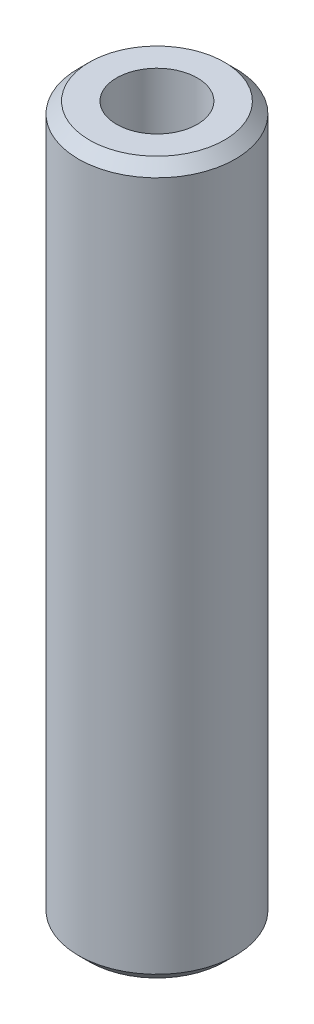
ISO-10303-21;
HEADER;
FILE_DESCRIPTION(('STEP AP214'),'2;1');
FILE_NAME('part.step','',(''),(''),'','','');
FILE_SCHEMA(('AUTOMOTIVE_DESIGN { 1 0 10303 214 1 1 1 1 }'));
ENDSEC;
DATA;
#1=APPLICATION_CONTEXT('core data for automotive mechanical design processes');
#2=APPLICATION_PROTOCOL_DEFINITION('international standard','automotive_design',2000,#1);
#3=PRODUCT_CONTEXT('',#1,'mechanical');
#4=PRODUCT('Part','Part','',(#3));
#5=PRODUCT_RELATED_PRODUCT_CATEGORY('part','',(#4));
#6=PRODUCT_DEFINITION_FORMATION('','',#4);
#7=PRODUCT_DEFINITION_CONTEXT('part definition',#1,'design');
#8=PRODUCT_DEFINITION('design','',#6,#7);
#9=PRODUCT_DEFINITION_SHAPE('','',#8);
#10=(LENGTH_UNIT() NAMED_UNIT(*) SI_UNIT(.MILLI.,.METRE.));
#11=(NAMED_UNIT(*) PLANE_ANGLE_UNIT() SI_UNIT($,.RADIAN.));
#12=(NAMED_UNIT(*) SI_UNIT($,.STERADIAN.) SOLID_ANGLE_UNIT());
#13=UNCERTAINTY_MEASURE_WITH_UNIT(LENGTH_MEASURE(1.E-05),#10,'distance_accuracy_value','');
#14=(GEOMETRIC_REPRESENTATION_CONTEXT(3) GLOBAL_UNCERTAINTY_ASSIGNED_CONTEXT((#13)) GLOBAL_UNIT_ASSIGNED_CONTEXT((#10,
#11,#12)) REPRESENTATION_CONTEXT('',''));
#15=CARTESIAN_POINT('',(0.,0.,0.));
#16=DIRECTION('',(0.,0.,1.));
#17=DIRECTION('',(1.,0.,0.));
#18=AXIS2_PLACEMENT_3D('',#15,#16,#17);
#19=CARTESIAN_POINT('',(0.,136.017494168894,0.));
#20=DIRECTION('',(0.,-1.,0.));
#21=DIRECTION('',(0.,0.,-1.));
#22=AXIS2_PLACEMENT_3D('',#19,#20,#21);
#23=CYLINDRICAL_SURFACE('',#22,15.);
#24=CARTESIAN_POINT('',(0.,133.919102665194,0.));
#25=DIRECTION('',(0.,1.,0.));
#26=DIRECTION('',(0.,0.,1.));
#27=AXIS2_PLACEMENT_3D('',#24,#25,#26);
#28=CIRCLE('',#27,15.);
#29=CARTESIAN_POINT('',(0.,133.919102665194,15.));
#30=VERTEX_POINT('',#29);
#31=EDGE_CURVE('E50',#30,#30,#28,.F.);
#32=ORIENTED_EDGE('',*,*,#31,.T.);
#33=EDGE_LOOP('',(#32));
#34=FACE_BOUND('',#33,.T.);
#35=CARTESIAN_POINT('',(0.,2.09839150369992,0.));
#36=DIRECTION('',(0.,1.,0.));
#37=DIRECTION('',(0.,0.,1.));
#38=AXIS2_PLACEMENT_3D('',#35,#36,#37);
#39=CIRCLE('',#38,15.);
#40=CARTESIAN_POINT('',(0.,2.09839150369992,15.));
#41=VERTEX_POINT('',#40);
#42=EDGE_CURVE('E51',#41,#41,#39,.T.);
#43=ORIENTED_EDGE('',*,*,#42,.T.);
#44=EDGE_LOOP('',(#43));
#45=FACE_BOUND('',#44,.T.);
#46=ADVANCED_FACE('F39',(#34,#45),#23,.T.);
#47=CARTESIAN_POINT('',(0.,136.017494168894,0.));
#48=DIRECTION('',(0.,1.,0.));
#49=DIRECTION('',(0.,0.,1.));
#50=AXIS2_PLACEMENT_3D('',#47,#48,#49);
#51=PLANE('',#50);
#52=CARTESIAN_POINT('',(0.,136.017494168894,0.));
#53=DIRECTION('',(0.,1.,0.));
#54=DIRECTION('',(0.,0.,1.));
#55=AXIS2_PLACEMENT_3D('',#52,#53,#54);
#56=CIRCLE('',#55,12.9016084963001);
#57=CARTESIAN_POINT('',(0.,136.017494168894,12.9016084963001));
#58=VERTEX_POINT('',#57);
#59=EDGE_CURVE('E54',#58,#58,#56,.T.);
#60=ORIENTED_EDGE('',*,*,#59,.T.);
#61=EDGE_LOOP('',(#60));
#62=FACE_BOUND('',#61,.T.);
#63=CARTESIAN_POINT('',(0.,136.017494168894,0.));
#64=DIRECTION('',(0.,1.,0.));
#65=DIRECTION('',(0.,0.,1.));
#66=AXIS2_PLACEMENT_3D('',#63,#64,#65);
#67=CIRCLE('',#66,7.70517447899924);
#68=CARTESIAN_POINT('',(0.,136.017494168894,7.70517447899924));
#69=VERTEX_POINT('',#68);
#70=EDGE_CURVE('E58',#69,#69,#67,.T.);
#71=ORIENTED_EDGE('',*,*,#70,.F.);
#72=EDGE_LOOP('',(#71));
#73=FACE_BOUND('',#72,.T.);
#74=ADVANCED_FACE('F69',(#62,#73),#51,.T.);
#75=CARTESIAN_POINT('',(0.,0.,0.));
#76=DIRECTION('',(0.,1.,0.));
#77=DIRECTION('',(0.,0.,1.));
#78=AXIS2_PLACEMENT_3D('',#75,#76,#77);
#79=PLANE('',#78);
#80=CARTESIAN_POINT('',(0.,0.,0.));
#81=DIRECTION('',(0.,1.,0.));
#82=DIRECTION('',(0.,0.,1.));
#83=AXIS2_PLACEMENT_3D('',#80,#81,#82);
#84=CIRCLE('',#83,12.9016084963001);
#85=CARTESIAN_POINT('',(0.,0.,12.9016084963001));
#86=VERTEX_POINT('',#85);
#87=EDGE_CURVE('E10',#86,#86,#84,.F.);
#88=ORIENTED_EDGE('',*,*,#87,.T.);
#89=EDGE_LOOP('',(#88));
#90=FACE_BOUND('',#89,.T.);
#91=CARTESIAN_POINT('',(0.,0.,0.));
#92=DIRECTION('',(0.,1.,0.));
#93=DIRECTION('',(0.,0.,1.));
#94=AXIS2_PLACEMENT_3D('',#91,#92,#93);
#95=CIRCLE('',#94,7.70517447899924);
#96=CARTESIAN_POINT('',(0.,0.,7.70517447899924));
#97=VERTEX_POINT('',#96);
#98=EDGE_CURVE('E63',#97,#97,#95,.T.);
#99=ORIENTED_EDGE('',*,*,#98,.T.);
#100=EDGE_LOOP('',(#99));
#101=FACE_BOUND('',#100,.T.);
#102=ADVANCED_FACE('F75',(#90,#101),#79,.F.);
#103=CARTESIAN_POINT('',(0.,136.017494168894,0.));
#104=DIRECTION('',(0.,-1.,0.));
#105=DIRECTION('',(0.,0.,-1.));
#106=AXIS2_PLACEMENT_3D('',#103,#104,#105);
#107=CYLINDRICAL_SURFACE('',#106,7.70517447899924);
#108=ORIENTED_EDGE('',*,*,#70,.T.);
#109=EDGE_LOOP('',(#108));
#110=FACE_BOUND('',#109,.T.);
#111=ORIENTED_EDGE('',*,*,#98,.F.);
#112=EDGE_LOOP('',(#111));
#113=FACE_BOUND('',#112,.T.);
#114=ADVANCED_FACE('F70',(#110,#113),#107,.F.);
#115=CARTESIAN_POINT('',(0.,136.017494168894,0.));
#116=DIRECTION('',(0.,-1.,0.));
#117=DIRECTION('',(0.,0.,-1.));
#118=AXIS2_PLACEMENT_3D('',#115,#116,#117);
#119=CONICAL_SURFACE('',#118,12.9016084963001,0.785398163397448);
#120=ORIENTED_EDGE('',*,*,#31,.F.);
#121=EDGE_LOOP('',(#120));
#122=FACE_BOUND('',#121,.T.);
#123=ORIENTED_EDGE('',*,*,#59,.F.);
#124=EDGE_LOOP('',(#123));
#125=FACE_BOUND('',#124,.T.);
#126=ADVANCED_FACE('F81',(#122,#125),#119,.T.);
#127=CARTESIAN_POINT('',(0.,2.09839150369992,0.));
#128=DIRECTION('',(0.,1.,0.));
#129=DIRECTION('',(0.,0.,1.));
#130=AXIS2_PLACEMENT_3D('',#127,#128,#129);
#131=CONICAL_SURFACE('',#130,15.,0.785398163397448);
#132=ORIENTED_EDGE('',*,*,#87,.F.);
#133=EDGE_LOOP('',(#132));
#134=FACE_BOUND('',#133,.T.);
#135=ORIENTED_EDGE('',*,*,#42,.F.);
#136=EDGE_LOOP('',(#135));
#137=FACE_BOUND('',#136,.T.);
#138=ADVANCED_FACE('F45',(#134,#137),#131,.T.);
#139=CLOSED_SHELL('',(#46,#74,#102,#114,#126,#138));
#140=MANIFOLD_SOLID_BREP('B2',#139);
#141=ADVANCED_BREP_SHAPE_REPRESENTATION('',(#18,#140),#14);
#142=SHAPE_DEFINITION_REPRESENTATION(#9,#141);
ENDSEC;
END-ISO-10303-21;
